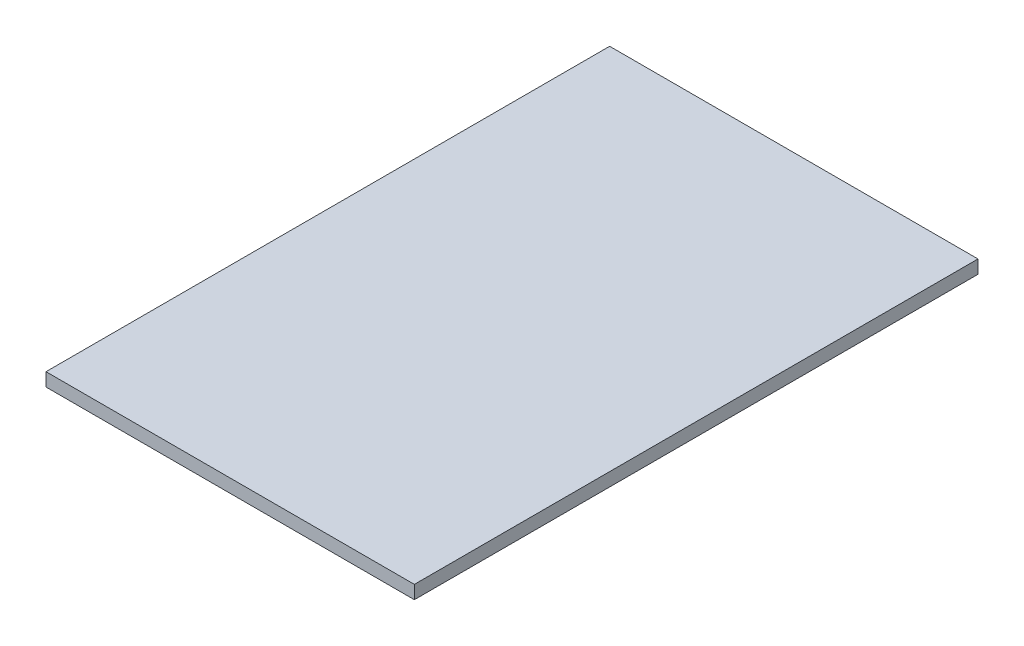
ISO-10303-21;
HEADER;
FILE_DESCRIPTION(('STEP AP214'),'2;1');
FILE_NAME('part.step','',(''),(''),'','','');
FILE_SCHEMA(('AUTOMOTIVE_DESIGN { 1 0 10303 214 1 1 1 1 }'));
ENDSEC;
DATA;
#1=APPLICATION_CONTEXT('core data for automotive mechanical design processes');
#2=APPLICATION_PROTOCOL_DEFINITION('international standard','automotive_design',2000,#1);
#3=PRODUCT_CONTEXT('',#1,'mechanical');
#4=PRODUCT('Part','Part','',(#3));
#5=PRODUCT_RELATED_PRODUCT_CATEGORY('part','',(#4));
#6=PRODUCT_DEFINITION_FORMATION('','',#4);
#7=PRODUCT_DEFINITION_CONTEXT('part definition',#1,'design');
#8=PRODUCT_DEFINITION('design','',#6,#7);
#9=PRODUCT_DEFINITION_SHAPE('','',#8);
#10=(LENGTH_UNIT() NAMED_UNIT(*) SI_UNIT(.MILLI.,.METRE.));
#11=(NAMED_UNIT(*) PLANE_ANGLE_UNIT() SI_UNIT($,.RADIAN.));
#12=(NAMED_UNIT(*) SI_UNIT($,.STERADIAN.) SOLID_ANGLE_UNIT());
#13=UNCERTAINTY_MEASURE_WITH_UNIT(LENGTH_MEASURE(1.E-05),#10,'distance_accuracy_value','');
#14=(GEOMETRIC_REPRESENTATION_CONTEXT(3) GLOBAL_UNCERTAINTY_ASSIGNED_CONTEXT((#13)) GLOBAL_UNIT_ASSIGNED_CONTEXT((#10,
#11,#12)) REPRESENTATION_CONTEXT('',''));
#15=CARTESIAN_POINT('',(0.,0.,0.));
#16=DIRECTION('',(0.,0.,1.));
#17=DIRECTION('',(1.,0.,0.));
#18=AXIS2_PLACEMENT_3D('',#15,#16,#17);
#19=CARTESIAN_POINT('',(-249.,18.,381.));
#20=DIRECTION('',(1.,0.,0.));
#21=DIRECTION('',(0.,0.,-1.));
#22=AXIS2_PLACEMENT_3D('',#19,#20,#21);
#23=PLANE('',#22);
#24=DIRECTION('',(0.,0.,1.));
#25=VECTOR('',#24,1.);
#26=CARTESIAN_POINT('',(-249.,0.,381.));
#27=LINE('',#26,#25);
#28=CARTESIAN_POINT('',(-249.,0.,-381.));
#29=VERTEX_POINT('',#28);
#30=CARTESIAN_POINT('',(-249.,0.,381.));
#31=VERTEX_POINT('',#30);
#32=EDGE_CURVE('E98',#29,#31,#27,.T.);
#33=ORIENTED_EDGE('',*,*,#32,.T.);
#34=DIRECTION('',(0.,-1.,0.));
#35=VECTOR('',#34,1.);
#36=CARTESIAN_POINT('',(-249.,18.,381.));
#37=LINE('',#36,#35);
#38=CARTESIAN_POINT('',(-249.,18.,381.));
#39=VERTEX_POINT('',#38);
#40=EDGE_CURVE('E11',#39,#31,#37,.T.);
#41=ORIENTED_EDGE('',*,*,#40,.F.);
#42=DIRECTION('',(0.,0.,1.));
#43=VECTOR('',#42,1.);
#44=CARTESIAN_POINT('',(-249.,18.,381.));
#45=LINE('',#44,#43);
#46=CARTESIAN_POINT('',(-249.,18.,-381.));
#47=VERTEX_POINT('',#46);
#48=EDGE_CURVE('E86',#47,#39,#45,.T.);
#49=ORIENTED_EDGE('',*,*,#48,.F.);
#50=DIRECTION('',(0.,-1.,0.));
#51=VECTOR('',#50,1.);
#52=CARTESIAN_POINT('',(-249.,18.,-381.));
#53=LINE('',#52,#51);
#54=EDGE_CURVE('E94',#47,#29,#53,.T.);
#55=ORIENTED_EDGE('',*,*,#54,.T.);
#56=EDGE_LOOP('',(#33,#41,#49,#55));
#57=FACE_BOUND('',#56,.T.);
#58=ADVANCED_FACE('F35',(#57),#23,.F.);
#59=CARTESIAN_POINT('',(249.,18.,381.));
#60=DIRECTION('',(0.,0.,-1.));
#61=DIRECTION('',(-1.,0.,0.));
#62=AXIS2_PLACEMENT_3D('',#59,#60,#61);
#63=PLANE('',#62);
#64=DIRECTION('',(1.,0.,0.));
#65=VECTOR('',#64,1.);
#66=CARTESIAN_POINT('',(249.,0.,381.));
#67=LINE('',#66,#65);
#68=CARTESIAN_POINT('',(249.,0.,381.));
#69=VERTEX_POINT('',#68);
#70=EDGE_CURVE('E90',#31,#69,#67,.T.);
#71=ORIENTED_EDGE('',*,*,#70,.T.);
#72=DIRECTION('',(0.,-1.,0.));
#73=VECTOR('',#72,1.);
#74=CARTESIAN_POINT('',(249.,18.,381.));
#75=LINE('',#74,#73);
#76=CARTESIAN_POINT('',(249.,18.,381.));
#77=VERTEX_POINT('',#76);
#78=EDGE_CURVE('E43',#77,#69,#75,.T.);
#79=ORIENTED_EDGE('',*,*,#78,.F.);
#80=DIRECTION('',(1.,0.,0.));
#81=VECTOR('',#80,1.);
#82=CARTESIAN_POINT('',(249.,18.,381.));
#83=LINE('',#82,#81);
#84=EDGE_CURVE('E81',#39,#77,#83,.T.);
#85=ORIENTED_EDGE('',*,*,#84,.F.);
#86=ORIENTED_EDGE('',*,*,#40,.T.);
#87=EDGE_LOOP('',(#71,#79,#85,#86));
#88=FACE_BOUND('',#87,.T.);
#89=ADVANCED_FACE('F89',(#88),#63,.F.);
#90=CARTESIAN_POINT('',(249.,18.,381.));
#91=DIRECTION('',(-1.,0.,0.));
#92=DIRECTION('',(0.,0.,1.));
#93=AXIS2_PLACEMENT_3D('',#90,#91,#92);
#94=PLANE('',#93);
#95=DIRECTION('',(0.,0.,-1.));
#96=VECTOR('',#95,1.);
#97=CARTESIAN_POINT('',(249.,0.,381.));
#98=LINE('',#97,#96);
#99=CARTESIAN_POINT('',(249.,0.,-381.));
#100=VERTEX_POINT('',#99);
#101=EDGE_CURVE('E68',#69,#100,#98,.T.);
#102=ORIENTED_EDGE('',*,*,#101,.T.);
#103=DIRECTION('',(0.,-1.,0.));
#104=VECTOR('',#103,1.);
#105=CARTESIAN_POINT('',(249.,18.,-381.));
#106=LINE('',#105,#104);
#107=CARTESIAN_POINT('',(249.,18.,-381.));
#108=VERTEX_POINT('',#107);
#109=EDGE_CURVE('E91',#108,#100,#106,.T.);
#110=ORIENTED_EDGE('',*,*,#109,.F.);
#111=DIRECTION('',(0.,0.,-1.));
#112=VECTOR('',#111,1.);
#113=CARTESIAN_POINT('',(249.,18.,381.));
#114=LINE('',#113,#112);
#115=EDGE_CURVE('E84',#77,#108,#114,.T.);
#116=ORIENTED_EDGE('',*,*,#115,.F.);
#117=ORIENTED_EDGE('',*,*,#78,.T.);
#118=EDGE_LOOP('',(#102,#110,#116,#117));
#119=FACE_BOUND('',#118,.T.);
#120=ADVANCED_FACE('F92',(#119),#94,.F.);
#121=CARTESIAN_POINT('',(249.,18.,-381.));
#122=DIRECTION('',(0.,0.,1.));
#123=DIRECTION('',(1.,0.,0.));
#124=AXIS2_PLACEMENT_3D('',#121,#122,#123);
#125=PLANE('',#124);
#126=DIRECTION('',(-1.,0.,0.));
#127=VECTOR('',#126,1.);
#128=CARTESIAN_POINT('',(249.,0.,-381.));
#129=LINE('',#128,#127);
#130=EDGE_CURVE('E74',#100,#29,#129,.T.);
#131=ORIENTED_EDGE('',*,*,#130,.T.);
#132=ORIENTED_EDGE('',*,*,#54,.F.);
#133=DIRECTION('',(-1.,0.,0.));
#134=VECTOR('',#133,1.);
#135=CARTESIAN_POINT('',(249.,18.,-381.));
#136=LINE('',#135,#134);
#137=EDGE_CURVE('E51',#108,#47,#136,.T.);
#138=ORIENTED_EDGE('',*,*,#137,.F.);
#139=ORIENTED_EDGE('',*,*,#109,.T.);
#140=EDGE_LOOP('',(#131,#132,#138,#139));
#141=FACE_BOUND('',#140,.T.);
#142=ADVANCED_FACE('F105',(#141),#125,.F.);
#143=CARTESIAN_POINT('',(0.,18.,0.));
#144=DIRECTION('',(0.,1.,0.));
#145=DIRECTION('',(0.,0.,1.));
#146=AXIS2_PLACEMENT_3D('',#143,#144,#145);
#147=PLANE('',#146);
#148=ORIENTED_EDGE('',*,*,#48,.T.);
#149=ORIENTED_EDGE('',*,*,#84,.T.);
#150=ORIENTED_EDGE('',*,*,#115,.T.);
#151=ORIENTED_EDGE('',*,*,#137,.T.);
#152=EDGE_LOOP('',(#148,#149,#150,#151));
#153=FACE_BOUND('',#152,.T.);
#154=ADVANCED_FACE('F82',(#153),#147,.T.);
#155=CARTESIAN_POINT('',(0.,0.,0.));
#156=DIRECTION('',(0.,1.,0.));
#157=DIRECTION('',(0.,0.,1.));
#158=AXIS2_PLACEMENT_3D('',#155,#156,#157);
#159=PLANE('',#158);
#160=ORIENTED_EDGE('',*,*,#32,.F.);
#161=ORIENTED_EDGE('',*,*,#130,.F.);
#162=ORIENTED_EDGE('',*,*,#101,.F.);
#163=ORIENTED_EDGE('',*,*,#70,.F.);
#164=EDGE_LOOP('',(#160,#161,#162,#163));
#165=FACE_BOUND('',#164,.T.);
#166=ADVANCED_FACE('F108',(#165),#159,.F.);
#167=CLOSED_SHELL('',(#58,#89,#120,#142,#154,#166));
#168=MANIFOLD_SOLID_BREP('B2',#167);
#169=ADVANCED_BREP_SHAPE_REPRESENTATION('',(#18,#168),#14);
#170=SHAPE_DEFINITION_REPRESENTATION(#9,#169);
ENDSEC;
END-ISO-10303-21;
